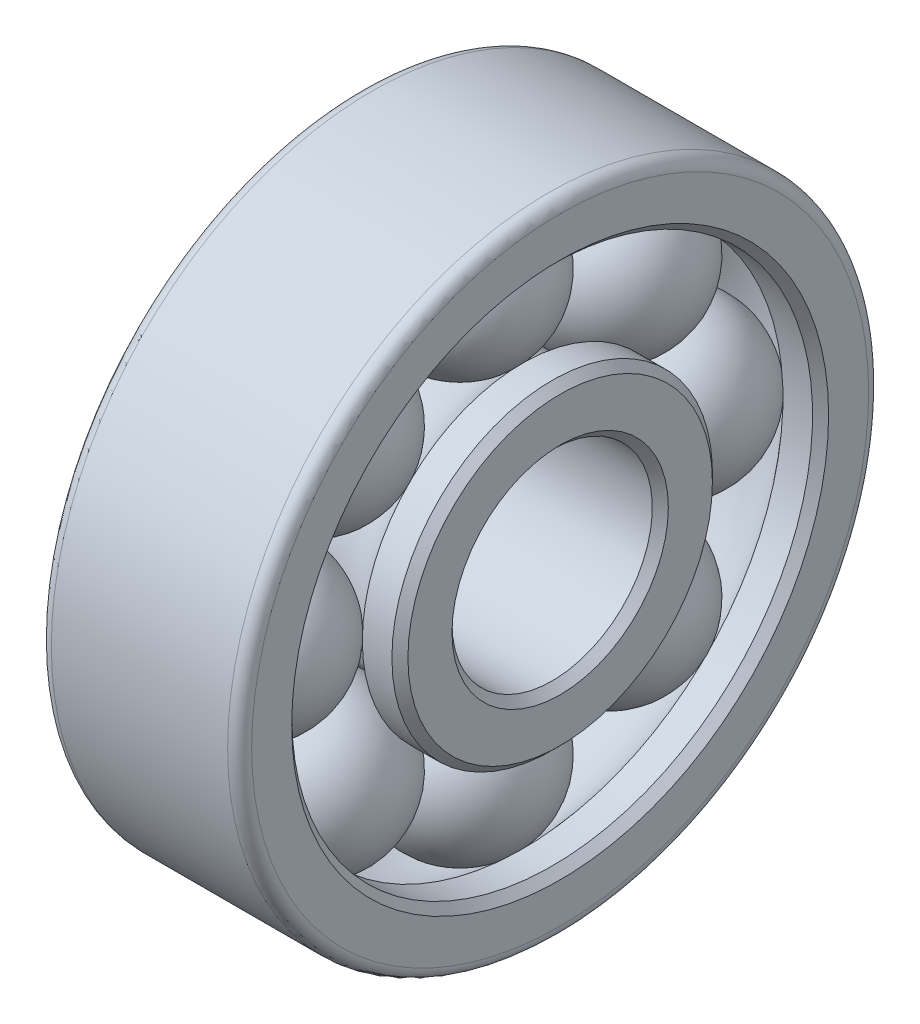
ISO-10303-21;
HEADER;
FILE_DESCRIPTION(('STEP AP214'),'2;1');
FILE_NAME('part.step','',(''),(''),'','','');
FILE_SCHEMA(('AUTOMOTIVE_DESIGN { 1 0 10303 214 1 1 1 1 }'));
ENDSEC;
DATA;
#1=APPLICATION_CONTEXT('core data for automotive mechanical design processes');
#2=APPLICATION_PROTOCOL_DEFINITION('international standard','automotive_design',2000,#1);
#3=PRODUCT_CONTEXT('',#1,'mechanical');
#4=PRODUCT('Part','Part','',(#3));
#5=PRODUCT_RELATED_PRODUCT_CATEGORY('part','',(#4));
#6=PRODUCT_DEFINITION_FORMATION('','',#4);
#7=PRODUCT_DEFINITION_CONTEXT('part definition',#1,'design');
#8=PRODUCT_DEFINITION('design','',#6,#7);
#9=PRODUCT_DEFINITION_SHAPE('','',#8);
#10=(LENGTH_UNIT() NAMED_UNIT(*) SI_UNIT(.MILLI.,.METRE.));
#11=(NAMED_UNIT(*) PLANE_ANGLE_UNIT() SI_UNIT($,.RADIAN.));
#12=(NAMED_UNIT(*) SI_UNIT($,.STERADIAN.) SOLID_ANGLE_UNIT());
#13=UNCERTAINTY_MEASURE_WITH_UNIT(LENGTH_MEASURE(1.E-05),#10,'distance_accuracy_value','');
#14=(GEOMETRIC_REPRESENTATION_CONTEXT(3) GLOBAL_UNCERTAINTY_ASSIGNED_CONTEXT((#13)) GLOBAL_UNIT_ASSIGNED_CONTEXT((#10,
#11,#12)) REPRESENTATION_CONTEXT('',''));
#15=CARTESIAN_POINT('',(0.,0.,0.));
#16=DIRECTION('',(0.,0.,1.));
#17=DIRECTION('',(1.,0.,0.));
#18=AXIS2_PLACEMENT_3D('',#15,#16,#17);
#19=CARTESIAN_POINT('',(2.5,1.21231060122942,3.71231060122933));
#20=DIRECTION('',(0.,0.707106781186556,0.707106781186539));
#21=DIRECTION('',(1.,0.,0.));
#22=AXIS2_PLACEMENT_3D('',#19,#20,#21);
#23=SPHERICAL_SURFACE('',#22,2.);
#24=CARTESIAN_POINT('',(2.5,2.62652416360253,5.12652416360241));
#25=VERTEX_POINT('',#24);
#26=VERTEX_LOOP('',#25);
#27=FACE_BOUND('',#26,.T.);
#28=ADVANCED_FACE('F41',(#27),#23,.T.);
#29=CLOSED_SHELL('',(#28));
#30=MANIFOLD_SOLID_BREP('B2',#29);
#31=CARTESIAN_POINT('',(2.5,-2.49999999999995,5.25));
#32=DIRECTION('',(0.,0.,1.));
#33=DIRECTION('',(1.,0.,0.));
#34=AXIS2_PLACEMENT_3D('',#31,#32,#33);
#35=SPHERICAL_SURFACE('',#34,2.);
#36=CARTESIAN_POINT('',(2.5,-2.49999999999992,7.25));
#37=VERTEX_POINT('',#36);
#38=VERTEX_LOOP('',#37);
#39=FACE_BOUND('',#38,.T.);
#40=ADVANCED_FACE('F61',(#39),#35,.T.);
#41=CLOSED_SHELL('',(#40));
#42=MANIFOLD_SOLID_BREP('B6',#41);
#43=CARTESIAN_POINT('',(2.5,-6.21231060122934,3.71231060122941));
#44=DIRECTION('',(0.,-0.707106781186541,0.707106781186554));
#45=DIRECTION('',(1.,0.,0.));
#46=AXIS2_PLACEMENT_3D('',#43,#44,#45);
#47=SPHERICAL_SURFACE('',#46,2.);
#48=CARTESIAN_POINT('',(2.5,-7.62652416360243,5.12652416360252));
#49=VERTEX_POINT('',#48);
#50=VERTEX_LOOP('',#49);
#51=FACE_BOUND('',#50,.T.);
#52=ADVANCED_FACE('F81',(#51),#47,.T.);
#53=CLOSED_SHELL('',(#52));
#54=MANIFOLD_SOLID_BREP('B37',#53);
#55=CARTESIAN_POINT('',(2.5,-7.75,0.));
#56=DIRECTION('',(0.,-1.,0.));
#57=DIRECTION('',(1.,0.,0.));
#58=AXIS2_PLACEMENT_3D('',#55,#56,#57);
#59=SPHERICAL_SURFACE('',#58,2.);
#60=CARTESIAN_POINT('',(2.5,-9.75,0.));
#61=VERTEX_POINT('',#60);
#62=VERTEX_LOOP('',#61);
#63=FACE_BOUND('',#62,.T.);
#64=ADVANCED_FACE('F101',(#63),#59,.T.);
#65=CLOSED_SHELL('',(#64));
#66=MANIFOLD_SOLID_BREP('B57',#65);
#67=CARTESIAN_POINT('',(2.5,-6.21231060122939,-3.71231060122936));
#68=DIRECTION('',(0.,-0.707106781186551,-0.707106781186544));
#69=DIRECTION('',(1.,0.,0.));
#70=AXIS2_PLACEMENT_3D('',#67,#68,#69);
#71=SPHERICAL_SURFACE('',#70,2.);
#72=CARTESIAN_POINT('',(2.5,-7.6265241636025,-5.12652416360244));
#73=VERTEX_POINT('',#72);
#74=VERTEX_LOOP('',#73);
#75=FACE_BOUND('',#74,.T.);
#76=ADVANCED_FACE('F121',(#75),#71,.T.);
#77=CLOSED_SHELL('',(#76));
#78=MANIFOLD_SOLID_BREP('B77',#77);
#79=CARTESIAN_POINT('',(2.5,-2.50000000000002,-5.25));
#80=DIRECTION('',(0.,0.,-1.));
#81=DIRECTION('',(1.,0.,0.));
#82=AXIS2_PLACEMENT_3D('',#79,#80,#81);
#83=SPHERICAL_SURFACE('',#82,2.);
#84=CARTESIAN_POINT('',(2.5,-2.50000000000003,-7.25));
#85=VERTEX_POINT('',#84);
#86=VERTEX_LOOP('',#85);
#87=FACE_BOUND('',#86,.T.);
#88=ADVANCED_FACE('F141',(#87),#83,.T.);
#89=CLOSED_SHELL('',(#88));
#90=MANIFOLD_SOLID_BREP('B97',#89);
#91=CARTESIAN_POINT('',(2.5,1.21231060122937,-3.71231060122938));
#92=DIRECTION('',(0.,0.707106781186546,-0.707106781186549));
#93=DIRECTION('',(1.,0.,0.));
#94=AXIS2_PLACEMENT_3D('',#91,#92,#93);
#95=SPHERICAL_SURFACE('',#94,2.);
#96=CARTESIAN_POINT('',(2.5,2.62652416360246,-5.12652416360248));
#97=VERTEX_POINT('',#96);
#98=VERTEX_LOOP('',#97);
#99=FACE_BOUND('',#98,.T.);
#100=ADVANCED_FACE('F161',(#99),#95,.T.);
#101=CLOSED_SHELL('',(#100));
#102=MANIFOLD_SOLID_BREP('B117',#101);
#103=CARTESIAN_POINT('',(2.5,2.75,0.));
#104=DIRECTION('',(0.,1.,0.));
#105=DIRECTION('',(1.,0.,0.));
#106=AXIS2_PLACEMENT_3D('',#103,#104,#105);
#107=SPHERICAL_SURFACE('',#106,2.);
#108=CARTESIAN_POINT('',(2.5,4.75,0.));
#109=VERTEX_POINT('',#108);
#110=VERTEX_LOOP('',#109);
#111=FACE_BOUND('',#110,.T.);
#112=ADVANCED_FACE('F183',(#111),#107,.T.);
#113=CLOSED_SHELL('',(#112));
#114=MANIFOLD_SOLID_BREP('B137',#113);
#115=CARTESIAN_POINT('',(0.,4.,0.));
#116=DIRECTION('',(1.,0.,0.));
#117=DIRECTION('',(0.,0.,-1.));
#118=AXIS2_PLACEMENT_3D('',#115,#116,#117);
#119=PLANE('',#118);
#120=CARTESIAN_POINT('',(0.,-2.5,0.));
#121=DIRECTION('',(1.,0.,0.));
#122=DIRECTION('',(0.,0.,-1.));
#123=AXIS2_PLACEMENT_3D('',#120,#121,#122);
#124=CIRCLE('',#123,6.7);
#125=CARTESIAN_POINT('',(0.,-2.5,-6.7));
#126=VERTEX_POINT('',#125);
#127=EDGE_CURVE('E182',#126,#126,#124,.T.);
#128=ORIENTED_EDGE('',*,*,#127,.T.);
#129=EDGE_LOOP('',(#128));
#130=FACE_BOUND('',#129,.T.);
#131=CARTESIAN_POINT('',(0.,-2.5,0.));
#132=DIRECTION('',(1.,0.,0.));
#133=DIRECTION('',(0.,0.,-1.));
#134=AXIS2_PLACEMENT_3D('',#131,#132,#133);
#135=CIRCLE('',#134,7.7);
#136=CARTESIAN_POINT('',(0.,-2.5,-7.7));
#137=VERTEX_POINT('',#136);
#138=EDGE_CURVE('E222',#137,#137,#135,.F.);
#139=ORIENTED_EDGE('',*,*,#138,.T.);
#140=EDGE_LOOP('',(#139));
#141=FACE_BOUND('',#140,.T.);
#142=ADVANCED_FACE('F202',(#130,#141),#119,.F.);
#143=CARTESIAN_POINT('',(-1.0669014084507,-2.5,0.));
#144=DIRECTION('',(-1.,0.,0.));
#145=DIRECTION('',(0.,0.,1.));
#146=AXIS2_PLACEMENT_3D('',#143,#144,#145);
#147=CYLINDRICAL_SURFACE('',#146,6.5);
#148=CARTESIAN_POINT('',(0.200000000000001,-2.5,0.));
#149=DIRECTION('',(1.,0.,0.));
#150=DIRECTION('',(0.,0.,-1.));
#151=AXIS2_PLACEMENT_3D('',#148,#149,#150);
#152=CIRCLE('',#151,6.5);
#153=CARTESIAN_POINT('',(0.200000000000001,-2.5,-6.5));
#154=VERTEX_POINT('',#153);
#155=EDGE_CURVE('E209',#154,#154,#152,.F.);
#156=ORIENTED_EDGE('',*,*,#155,.T.);
#157=EDGE_LOOP('',(#156));
#158=FACE_BOUND('',#157,.T.);
#159=CARTESIAN_POINT('',(0.938750500400401,-2.5,0.));
#160=DIRECTION('',(-1.,0.,0.));
#161=DIRECTION('',(0.,0.,1.));
#162=AXIS2_PLACEMENT_3D('',#159,#160,#161);
#163=CIRCLE('',#162,6.5);
#164=CARTESIAN_POINT('',(0.938750500400401,-2.5,6.5));
#165=VERTEX_POINT('',#164);
#166=EDGE_CURVE('E234',#165,#165,#163,.T.);
#167=ORIENTED_EDGE('',*,*,#166,.F.);
#168=EDGE_LOOP('',(#167));
#169=FACE_BOUND('',#168,.T.);
#170=ADVANCED_FACE('F246',(#158,#169),#147,.F.);
#171=CARTESIAN_POINT('',(2.5,-2.5,0.));
#172=DIRECTION('',(-1.,0.,0.));
#173=DIRECTION('',(0.,0.,1.));
#174=AXIS2_PLACEMENT_3D('',#171,#172,#173);
#175=TOROIDAL_SURFACE('',#174,5.25,2.);
#176=CARTESIAN_POINT('',(4.0612494995996,-2.5,0.));
#177=DIRECTION('',(-1.,0.,0.));
#178=DIRECTION('',(0.,0.,1.));
#179=AXIS2_PLACEMENT_3D('',#176,#177,#178);
#180=CIRCLE('',#179,6.5);
#181=CARTESIAN_POINT('',(4.0612494995996,-2.5,6.5));
#182=VERTEX_POINT('',#181);
#183=EDGE_CURVE('E237',#182,#182,#180,.T.);
#184=ORIENTED_EDGE('',*,*,#183,.F.);
#185=EDGE_LOOP('',(#184));
#186=FACE_BOUND('',#185,.T.);
#187=ORIENTED_EDGE('',*,*,#166,.T.);
#188=EDGE_LOOP('',(#187));
#189=FACE_BOUND('',#188,.T.);
#190=ADVANCED_FACE('F243',(#186,#189),#175,.F.);
#191=CARTESIAN_POINT('',(-1.0669014084507,-2.5,0.));
#192=DIRECTION('',(-1.,0.,0.));
#193=DIRECTION('',(0.,0.,1.));
#194=AXIS2_PLACEMENT_3D('',#191,#192,#193);
#195=CYLINDRICAL_SURFACE('',#194,6.5);
#196=CARTESIAN_POINT('',(4.8,-2.5,0.));
#197=DIRECTION('',(-1.,0.,0.));
#198=DIRECTION('',(0.,0.,1.));
#199=AXIS2_PLACEMENT_3D('',#196,#197,#198);
#200=CIRCLE('',#199,6.5);
#201=CARTESIAN_POINT('',(4.8,-2.5,6.5));
#202=VERTEX_POINT('',#201);
#203=EDGE_CURVE('E213',#202,#202,#200,.F.);
#204=ORIENTED_EDGE('',*,*,#203,.T.);
#205=EDGE_LOOP('',(#204));
#206=FACE_BOUND('',#205,.T.);
#207=ORIENTED_EDGE('',*,*,#183,.T.);
#208=EDGE_LOOP('',(#207));
#209=FACE_BOUND('',#208,.T.);
#210=ADVANCED_FACE('F241',(#206,#209),#195,.F.);
#211=CARTESIAN_POINT('',(5.,4.,0.));
#212=DIRECTION('',(-1.,0.,0.));
#213=DIRECTION('',(0.,0.,1.));
#214=AXIS2_PLACEMENT_3D('',#211,#212,#213);
#215=PLANE('',#214);
#216=CARTESIAN_POINT('',(5.,-2.5,0.));
#217=DIRECTION('',(-1.,0.,0.));
#218=DIRECTION('',(0.,0.,1.));
#219=AXIS2_PLACEMENT_3D('',#216,#217,#218);
#220=CIRCLE('',#219,6.7);
#221=CARTESIAN_POINT('',(5.,-2.5,6.7));
#222=VERTEX_POINT('',#221);
#223=EDGE_CURVE('E217',#222,#222,#220,.T.);
#224=ORIENTED_EDGE('',*,*,#223,.T.);
#225=EDGE_LOOP('',(#224));
#226=FACE_BOUND('',#225,.T.);
#227=CARTESIAN_POINT('',(5.,-2.5,0.));
#228=DIRECTION('',(-1.,0.,0.));
#229=DIRECTION('',(0.,0.,1.));
#230=AXIS2_PLACEMENT_3D('',#227,#228,#229);
#231=CIRCLE('',#230,7.7);
#232=CARTESIAN_POINT('',(5.,-2.5,7.7));
#233=VERTEX_POINT('',#232);
#234=EDGE_CURVE('E225',#233,#233,#231,.F.);
#235=ORIENTED_EDGE('',*,*,#234,.T.);
#236=EDGE_LOOP('',(#235));
#237=FACE_BOUND('',#236,.T.);
#238=ADVANCED_FACE('F277',(#226,#237),#215,.F.);
#239=CARTESIAN_POINT('',(-1.0669014084507,-2.5,0.));
#240=DIRECTION('',(-1.,0.,0.));
#241=DIRECTION('',(0.,0.,1.));
#242=AXIS2_PLACEMENT_3D('',#239,#240,#241);
#243=CYLINDRICAL_SURFACE('',#242,8.);
#244=CARTESIAN_POINT('',(4.7,-2.5,0.));
#245=DIRECTION('',(-1.,0.,0.));
#246=DIRECTION('',(0.,0.,1.));
#247=AXIS2_PLACEMENT_3D('',#244,#245,#246);
#248=CIRCLE('',#247,8.);
#249=CARTESIAN_POINT('',(4.7,-2.5,8.));
#250=VERTEX_POINT('',#249);
#251=EDGE_CURVE('E228',#250,#250,#248,.T.);
#252=ORIENTED_EDGE('',*,*,#251,.T.);
#253=EDGE_LOOP('',(#252));
#254=FACE_BOUND('',#253,.T.);
#255=CARTESIAN_POINT('',(0.3,-2.5,0.));
#256=DIRECTION('',(1.,0.,0.));
#257=DIRECTION('',(0.,0.,-1.));
#258=AXIS2_PLACEMENT_3D('',#255,#256,#257);
#259=CIRCLE('',#258,8.);
#260=CARTESIAN_POINT('',(0.3,-2.5,-8.));
#261=VERTEX_POINT('',#260);
#262=EDGE_CURVE('E231',#261,#261,#259,.T.);
#263=ORIENTED_EDGE('',*,*,#262,.T.);
#264=EDGE_LOOP('',(#263));
#265=FACE_BOUND('',#264,.T.);
#266=ADVANCED_FACE('F262',(#254,#265),#243,.T.);
#267=CARTESIAN_POINT('',(4.7,-2.5,0.));
#268=DIRECTION('',(-1.,0.,0.));
#269=DIRECTION('',(0.,0.,1.));
#270=AXIS2_PLACEMENT_3D('',#267,#268,#269);
#271=TOROIDAL_SURFACE('',#270,7.7,0.3);
#272=ORIENTED_EDGE('',*,*,#234,.F.);
#273=EDGE_LOOP('',(#272));
#274=FACE_BOUND('',#273,.T.);
#275=ORIENTED_EDGE('',*,*,#251,.F.);
#276=EDGE_LOOP('',(#275));
#277=FACE_BOUND('',#276,.T.);
#278=ADVANCED_FACE('F258',(#274,#277),#271,.T.);
#279=CARTESIAN_POINT('',(0.3,-2.5,0.));
#280=DIRECTION('',(1.,0.,0.));
#281=DIRECTION('',(0.,0.,-1.));
#282=AXIS2_PLACEMENT_3D('',#279,#280,#281);
#283=TOROIDAL_SURFACE('',#282,7.7,0.3);
#284=ORIENTED_EDGE('',*,*,#262,.F.);
#285=EDGE_LOOP('',(#284));
#286=FACE_BOUND('',#285,.T.);
#287=ORIENTED_EDGE('',*,*,#138,.F.);
#288=EDGE_LOOP('',(#287));
#289=FACE_BOUND('',#288,.T.);
#290=ADVANCED_FACE('F261',(#286,#289),#283,.T.);
#291=CARTESIAN_POINT('',(5.,-2.5,0.));
#292=DIRECTION('',(1.,0.,0.));
#293=DIRECTION('',(0.,0.,-1.));
#294=AXIS2_PLACEMENT_3D('',#291,#292,#293);
#295=CONICAL_SURFACE('',#294,6.7,0.78539816339744);
#296=ORIENTED_EDGE('',*,*,#203,.F.);
#297=EDGE_LOOP('',(#296));
#298=FACE_BOUND('',#297,.T.);
#299=ORIENTED_EDGE('',*,*,#223,.F.);
#300=EDGE_LOOP('',(#299));
#301=FACE_BOUND('',#300,.T.);
#302=ADVANCED_FACE('F265',(#298,#301),#295,.F.);
#303=CARTESIAN_POINT('',(0.200000000000001,-2.5,0.));
#304=DIRECTION('',(-1.,0.,0.));
#305=DIRECTION('',(0.,0.,1.));
#306=AXIS2_PLACEMENT_3D('',#303,#304,#305);
#307=CONICAL_SURFACE('',#306,6.5,0.785398163397446);
#308=ORIENTED_EDGE('',*,*,#127,.F.);
#309=EDGE_LOOP('',(#308));
#310=FACE_BOUND('',#309,.T.);
#311=ORIENTED_EDGE('',*,*,#155,.F.);
#312=EDGE_LOOP('',(#311));
#313=FACE_BOUND('',#312,.T.);
#314=ADVANCED_FACE('F204',(#310,#313),#307,.F.);
#315=CLOSED_SHELL('',(#142,#170,#190,#210,#238,#266,#278,#290,#302,#314));
#316=MANIFOLD_SOLID_BREP('B157',#315);
#317=CARTESIAN_POINT('',(0.,0.,0.));
#318=DIRECTION('',(1.,0.,0.));
#319=DIRECTION('',(0.,0.,-1.));
#320=AXIS2_PLACEMENT_3D('',#317,#318,#319);
#321=PLANE('',#320);
#322=CARTESIAN_POINT('',(0.,-2.5,0.));
#323=DIRECTION('',(1.,0.,0.));
#324=DIRECTION('',(0.,0.,-1.));
#325=AXIS2_PLACEMENT_3D('',#322,#323,#324);
#326=CIRCLE('',#325,2.7);
#327=CARTESIAN_POINT('',(0.,-2.5,-2.7));
#328=VERTEX_POINT('',#327);
#329=EDGE_CURVE('E377',#328,#328,#326,.T.);
#330=ORIENTED_EDGE('',*,*,#329,.T.);
#331=EDGE_LOOP('',(#330));
#332=FACE_BOUND('',#331,.T.);
#333=CARTESIAN_POINT('',(0.,-2.5,0.));
#334=DIRECTION('',(1.,0.,0.));
#335=DIRECTION('',(0.,0.,-1.));
#336=AXIS2_PLACEMENT_3D('',#333,#334,#335);
#337=CIRCLE('',#336,3.8);
#338=CARTESIAN_POINT('',(0.,-2.5,-3.8));
#339=VERTEX_POINT('',#338);
#340=EDGE_CURVE('E380',#339,#339,#337,.F.);
#341=ORIENTED_EDGE('',*,*,#340,.T.);
#342=EDGE_LOOP('',(#341));
#343=FACE_BOUND('',#342,.T.);
#344=ADVANCED_FACE('F357',(#332,#343),#321,.F.);
#345=CARTESIAN_POINT('',(-1.0669014084507,-2.5,0.));
#346=DIRECTION('',(-1.,0.,0.));
#347=DIRECTION('',(0.,0.,1.));
#348=AXIS2_PLACEMENT_3D('',#345,#346,#347);
#349=CYLINDRICAL_SURFACE('',#348,2.5);
#350=CARTESIAN_POINT('',(0.199999999999994,-2.5,0.));
#351=DIRECTION('',(1.,0.,0.));
#352=DIRECTION('',(0.,0.,-1.));
#353=AXIS2_PLACEMENT_3D('',#350,#351,#352);
#354=CIRCLE('',#353,2.5);
#355=CARTESIAN_POINT('',(0.199999999999994,-2.5,-2.5));
#356=VERTEX_POINT('',#355);
#357=EDGE_CURVE('E383',#356,#356,#354,.F.);
#358=ORIENTED_EDGE('',*,*,#357,.T.);
#359=EDGE_LOOP('',(#358));
#360=FACE_BOUND('',#359,.T.);
#361=CARTESIAN_POINT('',(4.8,-2.5,0.));
#362=DIRECTION('',(-1.,0.,0.));
#363=DIRECTION('',(0.,0.,1.));
#364=AXIS2_PLACEMENT_3D('',#361,#362,#363);
#365=CIRCLE('',#364,2.5);
#366=CARTESIAN_POINT('',(4.8,-2.5,2.5));
#367=VERTEX_POINT('',#366);
#368=EDGE_CURVE('E386',#367,#367,#365,.F.);
#369=ORIENTED_EDGE('',*,*,#368,.T.);
#370=EDGE_LOOP('',(#369));
#371=FACE_BOUND('',#370,.T.);
#372=ADVANCED_FACE('F411',(#360,#371),#349,.F.);
#373=CARTESIAN_POINT('',(5.,0.,0.));
#374=DIRECTION('',(-1.,0.,0.));
#375=DIRECTION('',(0.,0.,1.));
#376=AXIS2_PLACEMENT_3D('',#373,#374,#375);
#377=PLANE('',#376);
#378=CARTESIAN_POINT('',(5.,-2.5,0.));
#379=DIRECTION('',(-1.,0.,0.));
#380=DIRECTION('',(0.,0.,1.));
#381=AXIS2_PLACEMENT_3D('',#378,#379,#380);
#382=CIRCLE('',#381,2.7);
#383=CARTESIAN_POINT('',(5.,-2.5,2.7));
#384=VERTEX_POINT('',#383);
#385=EDGE_CURVE('E368',#384,#384,#382,.T.);
#386=ORIENTED_EDGE('',*,*,#385,.T.);
#387=EDGE_LOOP('',(#386));
#388=FACE_BOUND('',#387,.T.);
#389=CARTESIAN_POINT('',(5.,-2.5,0.));
#390=DIRECTION('',(-1.,0.,0.));
#391=DIRECTION('',(0.,0.,1.));
#392=AXIS2_PLACEMENT_3D('',#389,#390,#391);
#393=CIRCLE('',#392,3.8);
#394=CARTESIAN_POINT('',(5.,-2.5,3.8));
#395=VERTEX_POINT('',#394);
#396=EDGE_CURVE('E372',#395,#395,#393,.F.);
#397=ORIENTED_EDGE('',*,*,#396,.T.);
#398=EDGE_LOOP('',(#397));
#399=FACE_BOUND('',#398,.T.);
#400=ADVANCED_FACE('F406',(#388,#399),#377,.F.);
#401=CARTESIAN_POINT('',(-1.0669014084507,-2.5,0.));
#402=DIRECTION('',(-1.,0.,0.));
#403=DIRECTION('',(0.,0.,1.));
#404=AXIS2_PLACEMENT_3D('',#401,#402,#403);
#405=CYLINDRICAL_SURFACE('',#404,4.);
#406=CARTESIAN_POINT('',(4.8,-2.5,0.));
#407=DIRECTION('',(-1.,0.,0.));
#408=DIRECTION('',(0.,0.,1.));
#409=AXIS2_PLACEMENT_3D('',#406,#407,#408);
#410=CIRCLE('',#409,4.);
#411=CARTESIAN_POINT('',(4.8,-2.5,4.));
#412=VERTEX_POINT('',#411);
#413=EDGE_CURVE('E364',#412,#412,#410,.T.);
#414=ORIENTED_EDGE('',*,*,#413,.T.);
#415=EDGE_LOOP('',(#414));
#416=FACE_BOUND('',#415,.T.);
#417=CARTESIAN_POINT('',(4.0612494995996,-2.5,0.));
#418=DIRECTION('',(-1.,0.,0.));
#419=DIRECTION('',(0.,0.,1.));
#420=AXIS2_PLACEMENT_3D('',#417,#418,#419);
#421=CIRCLE('',#420,4.);
#422=CARTESIAN_POINT('',(4.0612494995996,-2.5,4.));
#423=VERTEX_POINT('',#422);
#424=EDGE_CURVE('E389',#423,#423,#421,.T.);
#425=ORIENTED_EDGE('',*,*,#424,.F.);
#426=EDGE_LOOP('',(#425));
#427=FACE_BOUND('',#426,.T.);
#428=ADVANCED_FACE('F401',(#416,#427),#405,.T.);
#429=CARTESIAN_POINT('',(2.5,-2.5,0.));
#430=DIRECTION('',(-1.,0.,0.));
#431=DIRECTION('',(0.,0.,1.));
#432=AXIS2_PLACEMENT_3D('',#429,#430,#431);
#433=TOROIDAL_SURFACE('',#432,5.25,2.);
#434=CARTESIAN_POINT('',(0.938750500400399,-2.5,0.));
#435=DIRECTION('',(-1.,0.,0.));
#436=DIRECTION('',(0.,0.,1.));
#437=AXIS2_PLACEMENT_3D('',#434,#435,#436);
#438=CIRCLE('',#437,4.);
#439=CARTESIAN_POINT('',(0.938750500400399,-2.5,4.));
#440=VERTEX_POINT('',#439);
#441=EDGE_CURVE('E392',#440,#440,#438,.T.);
#442=ORIENTED_EDGE('',*,*,#441,.F.);
#443=EDGE_LOOP('',(#442));
#444=FACE_BOUND('',#443,.T.);
#445=ORIENTED_EDGE('',*,*,#424,.T.);
#446=EDGE_LOOP('',(#445));
#447=FACE_BOUND('',#446,.T.);
#448=ADVANCED_FACE('F398',(#444,#447),#433,.F.);
#449=CARTESIAN_POINT('',(-1.0669014084507,-2.5,0.));
#450=DIRECTION('',(-1.,0.,0.));
#451=DIRECTION('',(0.,0.,1.));
#452=AXIS2_PLACEMENT_3D('',#449,#450,#451);
#453=CYLINDRICAL_SURFACE('',#452,4.);
#454=CARTESIAN_POINT('',(0.200000000000001,-2.5,0.));
#455=DIRECTION('',(1.,0.,0.));
#456=DIRECTION('',(0.,0.,-1.));
#457=AXIS2_PLACEMENT_3D('',#454,#455,#456);
#458=CIRCLE('',#457,4.);
#459=CARTESIAN_POINT('',(0.200000000000001,-2.5,-4.));
#460=VERTEX_POINT('',#459);
#461=EDGE_CURVE('E201',#460,#460,#458,.T.);
#462=ORIENTED_EDGE('',*,*,#461,.T.);
#463=EDGE_LOOP('',(#462));
#464=FACE_BOUND('',#463,.T.);
#465=ORIENTED_EDGE('',*,*,#441,.T.);
#466=EDGE_LOOP('',(#465));
#467=FACE_BOUND('',#466,.T.);
#468=ADVANCED_FACE('F396',(#464,#467),#453,.T.);
#469=CARTESIAN_POINT('',(0.199999999999994,-2.5,0.));
#470=DIRECTION('',(-1.,0.,0.));
#471=DIRECTION('',(0.,0.,1.));
#472=AXIS2_PLACEMENT_3D('',#469,#470,#471);
#473=CONICAL_SURFACE('',#472,2.5,0.785398163397453);
#474=ORIENTED_EDGE('',*,*,#329,.F.);
#475=EDGE_LOOP('',(#474));
#476=FACE_BOUND('',#475,.T.);
#477=ORIENTED_EDGE('',*,*,#357,.F.);
#478=EDGE_LOOP('',(#477));
#479=FACE_BOUND('',#478,.T.);
#480=ADVANCED_FACE('F424',(#476,#479),#473,.F.);
#481=CARTESIAN_POINT('',(5.,-2.5,0.));
#482=DIRECTION('',(1.,0.,0.));
#483=DIRECTION('',(0.,0.,-1.));
#484=AXIS2_PLACEMENT_3D('',#481,#482,#483);
#485=CONICAL_SURFACE('',#484,2.7,0.785398163397442);
#486=ORIENTED_EDGE('',*,*,#368,.F.);
#487=EDGE_LOOP('',(#486));
#488=FACE_BOUND('',#487,.T.);
#489=ORIENTED_EDGE('',*,*,#385,.F.);
#490=EDGE_LOOP('',(#489));
#491=FACE_BOUND('',#490,.T.);
#492=ADVANCED_FACE('F427',(#488,#491),#485,.F.);
#493=CARTESIAN_POINT('',(4.8,-2.5,0.));
#494=DIRECTION('',(-1.,0.,0.));
#495=DIRECTION('',(0.,0.,1.));
#496=AXIS2_PLACEMENT_3D('',#493,#494,#495);
#497=CONICAL_SURFACE('',#496,4.,0.78539816339745);
#498=ORIENTED_EDGE('',*,*,#396,.F.);
#499=EDGE_LOOP('',(#498));
#500=FACE_BOUND('',#499,.T.);
#501=ORIENTED_EDGE('',*,*,#413,.F.);
#502=EDGE_LOOP('',(#501));
#503=FACE_BOUND('',#502,.T.);
#504=ADVANCED_FACE('F430',(#500,#503),#497,.T.);
#505=CARTESIAN_POINT('',(0.,-2.5,0.));
#506=DIRECTION('',(1.,0.,0.));
#507=DIRECTION('',(0.,0.,-1.));
#508=AXIS2_PLACEMENT_3D('',#505,#506,#507);
#509=CONICAL_SURFACE('',#508,3.8,0.785398163397453);
#510=ORIENTED_EDGE('',*,*,#461,.F.);
#511=EDGE_LOOP('',(#510));
#512=FACE_BOUND('',#511,.T.);
#513=ORIENTED_EDGE('',*,*,#340,.F.);
#514=EDGE_LOOP('',(#513));
#515=FACE_BOUND('',#514,.T.);
#516=ADVANCED_FACE('F359',(#512,#515),#509,.T.);
#517=CLOSED_SHELL('',(#344,#372,#400,#428,#448,#468,#480,#492,#504,#516));
#518=MANIFOLD_SOLID_BREP('B177',#517);
#519=ADVANCED_BREP_SHAPE_REPRESENTATION('',(#18,#30,#42,#54,#66,#78,#90,#102,#114,#316,#518),#14);
#520=SHAPE_DEFINITION_REPRESENTATION(#9,#519);
ENDSEC;
END-ISO-10303-21;
